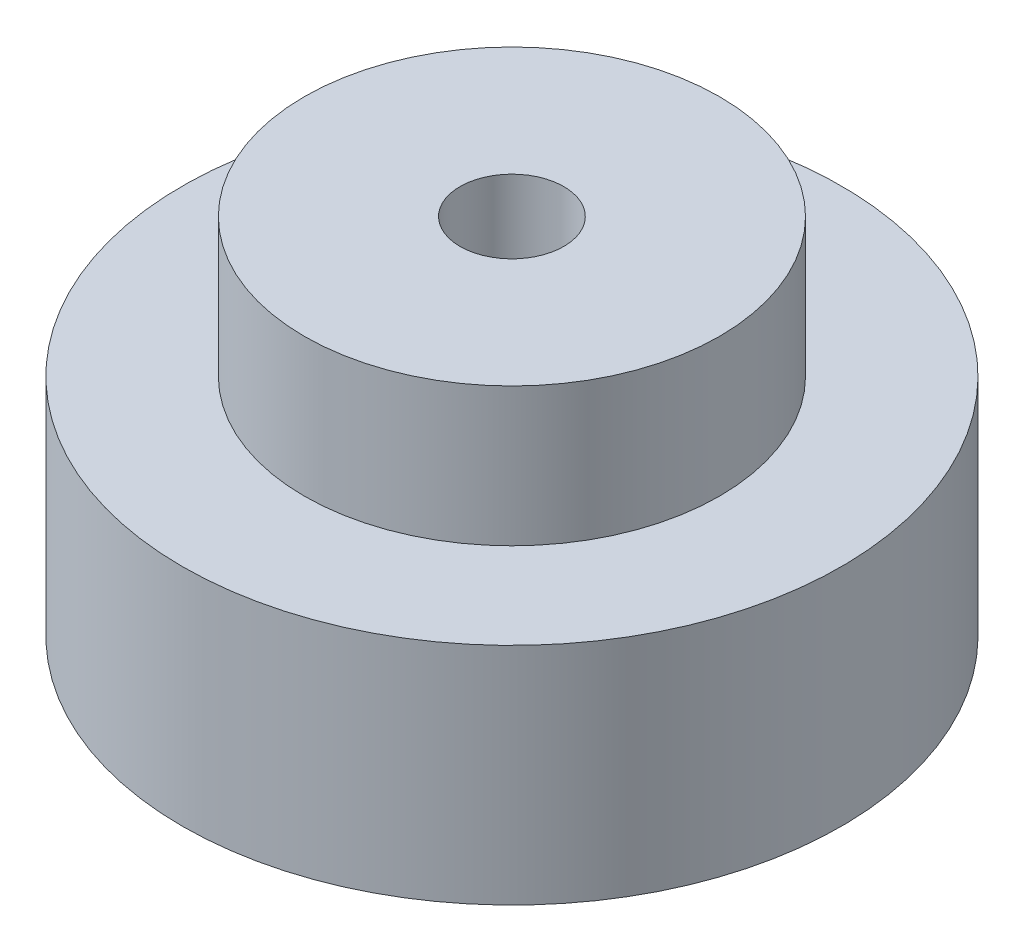
ISO-10303-21;
HEADER;
FILE_DESCRIPTION(('STEP AP214'),'2;1');
FILE_NAME('part.step','',(''),(''),'','','');
FILE_SCHEMA(('AUTOMOTIVE_DESIGN { 1 0 10303 214 1 1 1 1 }'));
ENDSEC;
DATA;
#1=APPLICATION_CONTEXT('core data for automotive mechanical design processes');
#2=APPLICATION_PROTOCOL_DEFINITION('international standard','automotive_design',2000,#1);
#3=PRODUCT_CONTEXT('',#1,'mechanical');
#4=PRODUCT('Part','Part','',(#3));
#5=PRODUCT_RELATED_PRODUCT_CATEGORY('part','',(#4));
#6=PRODUCT_DEFINITION_FORMATION('','',#4);
#7=PRODUCT_DEFINITION_CONTEXT('part definition',#1,'design');
#8=PRODUCT_DEFINITION('design','',#6,#7);
#9=PRODUCT_DEFINITION_SHAPE('','',#8);
#10=(LENGTH_UNIT() NAMED_UNIT(*) SI_UNIT(.MILLI.,.METRE.));
#11=(NAMED_UNIT(*) PLANE_ANGLE_UNIT() SI_UNIT($,.RADIAN.));
#12=(NAMED_UNIT(*) SI_UNIT($,.STERADIAN.) SOLID_ANGLE_UNIT());
#13=UNCERTAINTY_MEASURE_WITH_UNIT(LENGTH_MEASURE(1.E-05),#10,'distance_accuracy_value','');
#14=(GEOMETRIC_REPRESENTATION_CONTEXT(3) GLOBAL_UNCERTAINTY_ASSIGNED_CONTEXT((#13)) GLOBAL_UNIT_ASSIGNED_CONTEXT((#10,
#11,#12)) REPRESENTATION_CONTEXT('',''));
#15=CARTESIAN_POINT('',(0.,0.,0.));
#16=DIRECTION('',(0.,0.,1.));
#17=DIRECTION('',(1.,0.,0.));
#18=AXIS2_PLACEMENT_3D('',#15,#16,#17);
#19=CARTESIAN_POINT('',(0.,13.,0.));
#20=DIRECTION('',(0.,1.,0.));
#21=DIRECTION('',(0.,0.,1.));
#22=AXIS2_PLACEMENT_3D('',#19,#20,#21);
#23=PLANE('',#22);
#24=CARTESIAN_POINT('',(0.,13.,0.));
#25=DIRECTION('',(0.,1.,0.));
#26=DIRECTION('',(0.,0.,1.));
#27=AXIS2_PLACEMENT_3D('',#24,#25,#26);
#28=CIRCLE('',#27,19.05);
#29=CARTESIAN_POINT('',(0.,13.,19.05));
#30=VERTEX_POINT('',#29);
#31=EDGE_CURVE('E10',#30,#30,#28,.T.);
#32=ORIENTED_EDGE('',*,*,#31,.T.);
#33=EDGE_LOOP('',(#32));
#34=FACE_BOUND('',#33,.T.);
#35=CARTESIAN_POINT('',(0.,13.,0.));
#36=DIRECTION('',(0.,1.,0.));
#37=DIRECTION('',(0.,0.,1.));
#38=AXIS2_PLACEMENT_3D('',#35,#36,#37);
#39=CIRCLE('',#38,12.);
#40=CARTESIAN_POINT('',(0.,13.,12.));
#41=VERTEX_POINT('',#40);
#42=EDGE_CURVE('E50',#41,#41,#39,.T.);
#43=ORIENTED_EDGE('',*,*,#42,.F.);
#44=EDGE_LOOP('',(#43));
#45=FACE_BOUND('',#44,.T.);
#46=ADVANCED_FACE('F34',(#34,#45),#23,.T.);
#47=CARTESIAN_POINT('',(0.,0.,0.));
#48=DIRECTION('',(0.,1.,0.));
#49=DIRECTION('',(0.,0.,1.));
#50=AXIS2_PLACEMENT_3D('',#47,#48,#49);
#51=PLANE('',#50);
#52=CARTESIAN_POINT('',(0.,0.,0.));
#53=DIRECTION('',(0.,1.,0.));
#54=DIRECTION('',(0.,0.,1.));
#55=AXIS2_PLACEMENT_3D('',#52,#53,#54);
#56=CIRCLE('',#55,19.05);
#57=CARTESIAN_POINT('',(0.,0.,19.05));
#58=VERTEX_POINT('',#57);
#59=EDGE_CURVE('E38',#58,#58,#56,.T.);
#60=ORIENTED_EDGE('',*,*,#59,.F.);
#61=EDGE_LOOP('',(#60));
#62=FACE_BOUND('',#61,.T.);
#63=CARTESIAN_POINT('',(0.,0.,0.));
#64=DIRECTION('',(0.,1.,0.));
#65=DIRECTION('',(0.,0.,1.));
#66=AXIS2_PLACEMENT_3D('',#63,#64,#65);
#67=CIRCLE('',#66,3.);
#68=CARTESIAN_POINT('',(0.,0.,3.));
#69=VERTEX_POINT('',#68);
#70=EDGE_CURVE('E45',#69,#69,#67,.T.);
#71=ORIENTED_EDGE('',*,*,#70,.T.);
#72=EDGE_LOOP('',(#71));
#73=FACE_BOUND('',#72,.T.);
#74=ADVANCED_FACE('F75',(#62,#73),#51,.F.);
#75=CARTESIAN_POINT('',(0.,13.,0.));
#76=DIRECTION('',(0.,-1.,0.));
#77=DIRECTION('',(0.,0.,-1.));
#78=AXIS2_PLACEMENT_3D('',#75,#76,#77);
#79=CYLINDRICAL_SURFACE('',#78,19.05);
#80=ORIENTED_EDGE('',*,*,#31,.F.);
#81=EDGE_LOOP('',(#80));
#82=FACE_BOUND('',#81,.T.);
#83=ORIENTED_EDGE('',*,*,#59,.T.);
#84=EDGE_LOOP('',(#83));
#85=FACE_BOUND('',#84,.T.);
#86=ADVANCED_FACE('F36',(#82,#85),#79,.T.);
#87=CARTESIAN_POINT('',(0.,13.,0.));
#88=DIRECTION('',(0.,-1.,0.));
#89=DIRECTION('',(0.,0.,-1.));
#90=AXIS2_PLACEMENT_3D('',#87,#88,#89);
#91=CYLINDRICAL_SURFACE('',#90,3.);
#92=ORIENTED_EDGE('',*,*,#70,.F.);
#93=EDGE_LOOP('',(#92));
#94=FACE_BOUND('',#93,.T.);
#95=CARTESIAN_POINT('',(0.,21.,0.));
#96=DIRECTION('',(0.,1.,0.));
#97=DIRECTION('',(0.,0.,1.));
#98=AXIS2_PLACEMENT_3D('',#95,#96,#97);
#99=CIRCLE('',#98,3.);
#100=CARTESIAN_POINT('',(0.,21.,3.));
#101=VERTEX_POINT('',#100);
#102=EDGE_CURVE('E53',#101,#101,#99,.T.);
#103=ORIENTED_EDGE('',*,*,#102,.T.);
#104=EDGE_LOOP('',(#103));
#105=FACE_BOUND('',#104,.T.);
#106=ADVANCED_FACE('F59',(#94,#105),#91,.F.);
#107=CARTESIAN_POINT('',(0.,21.,0.));
#108=DIRECTION('',(0.,1.,0.));
#109=DIRECTION('',(0.,0.,1.));
#110=AXIS2_PLACEMENT_3D('',#107,#108,#109);
#111=PLANE('',#110);
#112=CARTESIAN_POINT('',(0.,21.,0.));
#113=DIRECTION('',(0.,1.,0.));
#114=DIRECTION('',(0.,0.,1.));
#115=AXIS2_PLACEMENT_3D('',#112,#113,#114);
#116=CIRCLE('',#115,12.);
#117=CARTESIAN_POINT('',(0.,21.,12.));
#118=VERTEX_POINT('',#117);
#119=EDGE_CURVE('E49',#118,#118,#116,.T.);
#120=ORIENTED_EDGE('',*,*,#119,.T.);
#121=EDGE_LOOP('',(#120));
#122=FACE_BOUND('',#121,.T.);
#123=ORIENTED_EDGE('',*,*,#102,.F.);
#124=EDGE_LOOP('',(#123));
#125=FACE_BOUND('',#124,.T.);
#126=ADVANCED_FACE('F61',(#122,#125),#111,.T.);
#127=CARTESIAN_POINT('',(0.,21.,0.));
#128=DIRECTION('',(0.,-1.,0.));
#129=DIRECTION('',(0.,0.,-1.));
#130=AXIS2_PLACEMENT_3D('',#127,#128,#129);
#131=CYLINDRICAL_SURFACE('',#130,12.);
#132=ORIENTED_EDGE('',*,*,#119,.F.);
#133=EDGE_LOOP('',(#132));
#134=FACE_BOUND('',#133,.T.);
#135=ORIENTED_EDGE('',*,*,#42,.T.);
#136=EDGE_LOOP('',(#135));
#137=FACE_BOUND('',#136,.T.);
#138=ADVANCED_FACE('F63',(#134,#137),#131,.T.);
#139=CLOSED_SHELL('',(#46,#74,#86,#106,#126,#138));
#140=MANIFOLD_SOLID_BREP('B2',#139);
#141=ADVANCED_BREP_SHAPE_REPRESENTATION('',(#18,#140),#14);
#142=SHAPE_DEFINITION_REPRESENTATION(#9,#141);
ENDSEC;
END-ISO-10303-21;
